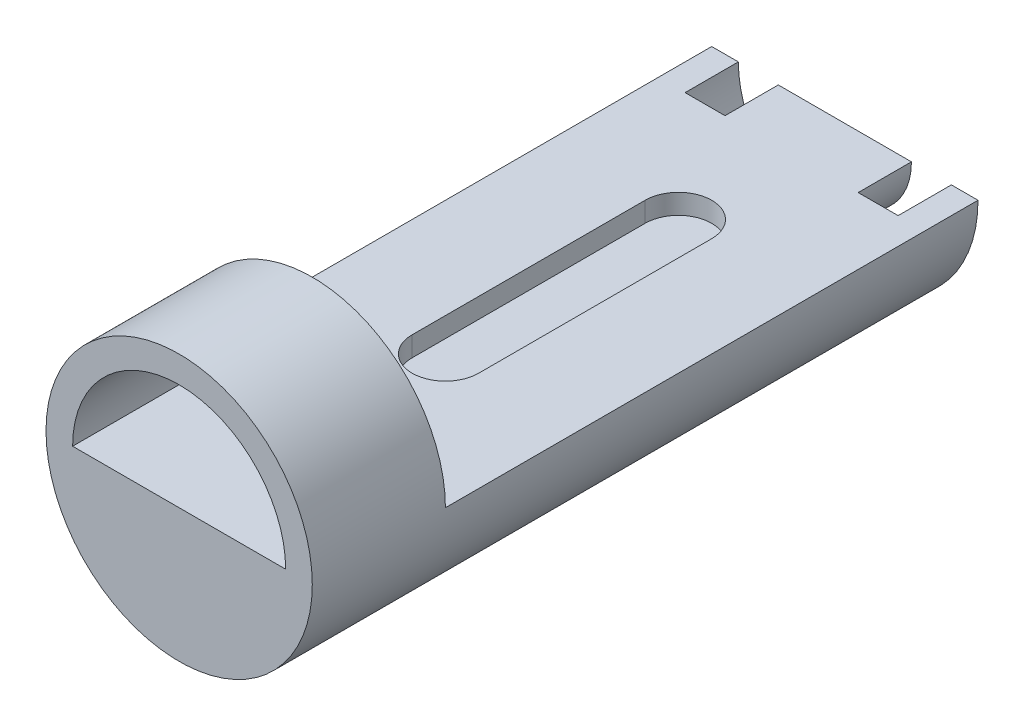
ISO-10303-21;
HEADER;
FILE_DESCRIPTION(('STEP AP214'),'2;1');
FILE_NAME('part.step','',(''),(''),'','','');
FILE_SCHEMA(('AUTOMOTIVE_DESIGN { 1 0 10303 214 1 1 1 1 }'));
ENDSEC;
DATA;
#1=APPLICATION_CONTEXT('core data for automotive mechanical design processes');
#2=APPLICATION_PROTOCOL_DEFINITION('international standard','automotive_design',2000,#1);
#3=PRODUCT_CONTEXT('',#1,'mechanical');
#4=PRODUCT('Part','Part','',(#3));
#5=PRODUCT_RELATED_PRODUCT_CATEGORY('part','',(#4));
#6=PRODUCT_DEFINITION_FORMATION('','',#4);
#7=PRODUCT_DEFINITION_CONTEXT('part definition',#1,'design');
#8=PRODUCT_DEFINITION('design','',#6,#7);
#9=PRODUCT_DEFINITION_SHAPE('','',#8);
#10=(LENGTH_UNIT() NAMED_UNIT(*) SI_UNIT(.MILLI.,.METRE.));
#11=(NAMED_UNIT(*) PLANE_ANGLE_UNIT() SI_UNIT($,.RADIAN.));
#12=(NAMED_UNIT(*) SI_UNIT($,.STERADIAN.) SOLID_ANGLE_UNIT());
#13=UNCERTAINTY_MEASURE_WITH_UNIT(LENGTH_MEASURE(1.E-05),#10,'distance_accuracy_value','');
#14=(GEOMETRIC_REPRESENTATION_CONTEXT(3) GLOBAL_UNCERTAINTY_ASSIGNED_CONTEXT((#13)) GLOBAL_UNIT_ASSIGNED_CONTEXT((#10,
#11,#12)) REPRESENTATION_CONTEXT('',''));
#15=CARTESIAN_POINT('',(0.,0.,0.));
#16=DIRECTION('',(0.,0.,1.));
#17=DIRECTION('',(1.,0.,0.));
#18=AXIS2_PLACEMENT_3D('',#15,#16,#17);
#19=CARTESIAN_POINT('',(10.,0.,100.));
#20=DIRECTION('',(0.,-1.,0.));
#21=DIRECTION('',(0.,0.,-1.));
#22=AXIS2_PLACEMENT_3D('',#19,#20,#21);
#23=PLANE('',#22);
#24=DIRECTION('',(0.,0.,1.));
#25=VECTOR('',#24,1.);
#26=CARTESIAN_POINT('',(-5.,0.,25.));
#27=LINE('',#26,#25);
#28=CARTESIAN_POINT('',(-5.,0.,25.));
#29=VERTEX_POINT('',#28);
#30=CARTESIAN_POINT('',(-5.00000000000001,0.,60.));
#31=VERTEX_POINT('',#30);
#32=EDGE_CURVE('E234',#29,#31,#27,.T.);
#33=ORIENTED_EDGE('',*,*,#32,.F.);
#34=CARTESIAN_POINT('',(0.,0.,25.));
#35=DIRECTION('',(0.,1.,0.));
#36=DIRECTION('',(0.,0.,1.));
#37=AXIS2_PLACEMENT_3D('',#34,#35,#36);
#38=CIRCLE('',#37,5.);
#39=CARTESIAN_POINT('',(5.,0.,25.));
#40=VERTEX_POINT('',#39);
#41=EDGE_CURVE('E63',#40,#29,#38,.T.);
#42=ORIENTED_EDGE('',*,*,#41,.F.);
#43=DIRECTION('',(0.,0.,1.));
#44=VECTOR('',#43,1.);
#45=CARTESIAN_POINT('',(5.,0.,25.));
#46=LINE('',#45,#44);
#47=CARTESIAN_POINT('',(4.99999999999999,0.,60.));
#48=VERTEX_POINT('',#47);
#49=EDGE_CURVE('E227',#40,#48,#46,.T.);
#50=ORIENTED_EDGE('',*,*,#49,.T.);
#51=CARTESIAN_POINT('',(0.,0.,60.));
#52=DIRECTION('',(0.,1.,0.));
#53=DIRECTION('',(0.,0.,1.));
#54=AXIS2_PLACEMENT_3D('',#51,#52,#53);
#55=CIRCLE('',#54,5.);
#56=EDGE_CURVE('E231',#31,#48,#55,.T.);
#57=ORIENTED_EDGE('',*,*,#56,.F.);
#58=EDGE_LOOP('',(#33,#42,#50,#57));
#59=FACE_BOUND('',#58,.T.);
#60=DIRECTION('',(0.,0.,1.));
#61=VECTOR('',#60,1.);
#62=CARTESIAN_POINT('',(16.,0.,80.));
#63=LINE('',#62,#61);
#64=CARTESIAN_POINT('',(16.,0.,80.));
#65=VERTEX_POINT('',#64);
#66=CARTESIAN_POINT('',(16.,0.,100.));
#67=VERTEX_POINT('',#66);
#68=EDGE_CURVE('E142',#65,#67,#63,.T.);
#69=ORIENTED_EDGE('',*,*,#68,.F.);
#70=DIRECTION('',(-1.,0.,0.));
#71=VECTOR('',#70,1.);
#72=CARTESIAN_POINT('',(0.,0.,80.));
#73=LINE('',#72,#71);
#74=CARTESIAN_POINT('',(20.,0.,80.));
#75=VERTEX_POINT('',#74);
#76=EDGE_CURVE('E128',#75,#65,#73,.T.);
#77=ORIENTED_EDGE('',*,*,#76,.F.);
#78=DIRECTION('',(0.,0.,-1.));
#79=VECTOR('',#78,1.);
#80=CARTESIAN_POINT('',(20.,0.,100.));
#81=LINE('',#80,#79);
#82=CARTESIAN_POINT('',(20.,0.,0.));
#83=VERTEX_POINT('',#82);
#84=EDGE_CURVE('E48',#75,#83,#81,.T.);
#85=ORIENTED_EDGE('',*,*,#84,.T.);
#86=DIRECTION('',(-1.,0.,0.));
#87=VECTOR('',#86,1.);
#88=CARTESIAN_POINT('',(10.,0.,0.));
#89=LINE('',#88,#87);
#90=CARTESIAN_POINT('',(16.,0.,0.));
#91=VERTEX_POINT('',#90);
#92=EDGE_CURVE('E158',#83,#91,#89,.T.);
#93=ORIENTED_EDGE('',*,*,#92,.T.);
#94=DIRECTION('',(0.,0.,-1.));
#95=VECTOR('',#94,1.);
#96=CARTESIAN_POINT('',(16.,0.,8.));
#97=LINE('',#96,#95);
#98=CARTESIAN_POINT('',(16.,0.,8.));
#99=VERTEX_POINT('',#98);
#100=EDGE_CURVE('E210',#99,#91,#97,.T.);
#101=ORIENTED_EDGE('',*,*,#100,.F.);
#102=DIRECTION('',(1.,0.,0.));
#103=VECTOR('',#102,1.);
#104=CARTESIAN_POINT('',(0.,0.,8.));
#105=LINE('',#104,#103);
#106=CARTESIAN_POINT('',(10.,0.,8.));
#107=VERTEX_POINT('',#106);
#108=EDGE_CURVE('E214',#107,#99,#105,.T.);
#109=ORIENTED_EDGE('',*,*,#108,.F.);
#110=DIRECTION('',(0.,0.,-1.));
#111=VECTOR('',#110,1.);
#112=CARTESIAN_POINT('',(10.,0.,8.));
#113=LINE('',#112,#111);
#114=CARTESIAN_POINT('',(10.,0.,0.));
#115=VERTEX_POINT('',#114);
#116=EDGE_CURVE('E163',#107,#115,#113,.T.);
#117=ORIENTED_EDGE('',*,*,#116,.T.);
#118=CARTESIAN_POINT('',(-10.,0.,0.));
#119=VERTEX_POINT('',#118);
#120=EDGE_CURVE('E173',#115,#119,#89,.T.);
#121=ORIENTED_EDGE('',*,*,#120,.T.);
#122=DIRECTION('',(0.,0.,-1.));
#123=VECTOR('',#122,1.);
#124=CARTESIAN_POINT('',(-10.,0.,8.));
#125=LINE('',#124,#123);
#126=CARTESIAN_POINT('',(-10.,0.,8.));
#127=VERTEX_POINT('',#126);
#128=EDGE_CURVE('E171',#127,#119,#125,.T.);
#129=ORIENTED_EDGE('',*,*,#128,.F.);
#130=CARTESIAN_POINT('',(-16.,0.,8.));
#131=VERTEX_POINT('',#130);
#132=EDGE_CURVE('E212',#131,#127,#105,.T.);
#133=ORIENTED_EDGE('',*,*,#132,.F.);
#134=DIRECTION('',(0.,0.,-1.));
#135=VECTOR('',#134,1.);
#136=CARTESIAN_POINT('',(-16.,0.,8.));
#137=LINE('',#136,#135);
#138=CARTESIAN_POINT('',(-16.,0.,0.));
#139=VERTEX_POINT('',#138);
#140=EDGE_CURVE('E188',#131,#139,#137,.T.);
#141=ORIENTED_EDGE('',*,*,#140,.T.);
#142=CARTESIAN_POINT('',(-20.,0.,0.));
#143=VERTEX_POINT('',#142);
#144=EDGE_CURVE('E170',#139,#143,#89,.T.);
#145=ORIENTED_EDGE('',*,*,#144,.T.);
#146=DIRECTION('',(0.,0.,-1.));
#147=VECTOR('',#146,1.);
#148=CARTESIAN_POINT('',(-20.,0.,100.));
#149=LINE('',#148,#147);
#150=CARTESIAN_POINT('',(-20.,0.,80.));
#151=VERTEX_POINT('',#150);
#152=EDGE_CURVE('E11',#151,#143,#149,.T.);
#153=ORIENTED_EDGE('',*,*,#152,.F.);
#154=CARTESIAN_POINT('',(-16.,0.,80.));
#155=VERTEX_POINT('',#154);
#156=EDGE_CURVE('E139',#155,#151,#73,.T.);
#157=ORIENTED_EDGE('',*,*,#156,.F.);
#158=DIRECTION('',(0.,0.,1.));
#159=VECTOR('',#158,1.);
#160=CARTESIAN_POINT('',(-16.,0.,80.));
#161=LINE('',#160,#159);
#162=CARTESIAN_POINT('',(-16.,0.,100.));
#163=VERTEX_POINT('',#162);
#164=EDGE_CURVE('E145',#155,#163,#161,.T.);
#165=ORIENTED_EDGE('',*,*,#164,.T.);
#166=DIRECTION('',(-1.,0.,0.));
#167=VECTOR('',#166,1.);
#168=CARTESIAN_POINT('',(0.,0.,100.));
#169=LINE('',#168,#167);
#170=EDGE_CURVE('E148',#67,#163,#169,.T.);
#171=ORIENTED_EDGE('',*,*,#170,.F.);
#172=EDGE_LOOP('',(#69,#77,#85,#93,#101,#109,#117,#121,#129,#133,#141,#145,#153,#157,#165,#171));
#173=FACE_BOUND('',#172,.T.);
#174=ADVANCED_FACE('F39',(#59,#173),#23,.F.);
#175=CARTESIAN_POINT('',(0.,0.,0.));
#176=DIRECTION('',(0.,0.,1.));
#177=DIRECTION('',(1.,0.,0.));
#178=AXIS2_PLACEMENT_3D('',#175,#176,#177);
#179=PLANE('',#178);
#180=CARTESIAN_POINT('',(0.,0.,0.));
#181=DIRECTION('',(0.,0.,-1.));
#182=DIRECTION('',(-1.,0.,0.));
#183=AXIS2_PLACEMENT_3D('',#180,#181,#182);
#184=CIRCLE('',#183,10.);
#185=EDGE_CURVE('E197',#115,#119,#184,.T.);
#186=ORIENTED_EDGE('',*,*,#185,.T.);
#187=ORIENTED_EDGE('',*,*,#120,.F.);
#188=EDGE_LOOP('',(#186,#187));
#189=FACE_BOUND('',#188,.T.);
#190=ADVANCED_FACE('F196',(#189),#179,.F.);
#191=CARTESIAN_POINT('',(0.,0.,100.));
#192=DIRECTION('',(0.,0.,-1.));
#193=DIRECTION('',(-1.,0.,0.));
#194=AXIS2_PLACEMENT_3D('',#191,#192,#193);
#195=CYLINDRICAL_SURFACE('',#194,20.);
#196=CARTESIAN_POINT('',(0.,0.,80.));
#197=DIRECTION('',(0.,0.,1.));
#198=DIRECTION('',(1.,0.,0.));
#199=AXIS2_PLACEMENT_3D('',#196,#197,#198);
#200=CIRCLE('',#199,20.);
#201=EDGE_CURVE('E134',#75,#151,#200,.T.);
#202=ORIENTED_EDGE('',*,*,#201,.T.);
#203=ORIENTED_EDGE('',*,*,#152,.T.);
#204=CARTESIAN_POINT('',(0.,0.,0.));
#205=DIRECTION('',(0.,0.,1.));
#206=DIRECTION('',(1.,0.,0.));
#207=AXIS2_PLACEMENT_3D('',#204,#205,#206);
#208=CIRCLE('',#207,20.);
#209=EDGE_CURVE('E167',#143,#83,#208,.T.);
#210=ORIENTED_EDGE('',*,*,#209,.T.);
#211=ORIENTED_EDGE('',*,*,#84,.F.);
#212=EDGE_LOOP('',(#202,#203,#210,#211));
#213=FACE_BOUND('',#212,.T.);
#214=CARTESIAN_POINT('',(0.,0.,100.));
#215=DIRECTION('',(0.,0.,1.));
#216=DIRECTION('',(1.,0.,0.));
#217=AXIS2_PLACEMENT_3D('',#214,#215,#216);
#218=CIRCLE('',#217,20.);
#219=CARTESIAN_POINT('',(20.,0.,100.));
#220=VERTEX_POINT('',#219);
#221=EDGE_CURVE('E157',#220,#220,#218,.T.);
#222=ORIENTED_EDGE('',*,*,#221,.F.);
#223=EDGE_LOOP('',(#222));
#224=FACE_BOUND('',#223,.T.);
#225=ADVANCED_FACE('F41',(#213,#224),#195,.T.);
#226=CARTESIAN_POINT('',(0.,0.,100.));
#227=DIRECTION('',(0.,0.,1.));
#228=DIRECTION('',(1.,0.,0.));
#229=AXIS2_PLACEMENT_3D('',#226,#227,#228);
#230=PLANE('',#229);
#231=ORIENTED_EDGE('',*,*,#221,.T.);
#232=EDGE_LOOP('',(#231));
#233=FACE_BOUND('',#232,.T.);
#234=ORIENTED_EDGE('',*,*,#170,.T.);
#235=CARTESIAN_POINT('',(0.,0.,100.));
#236=DIRECTION('',(0.,0.,1.));
#237=DIRECTION('',(1.,0.,0.));
#238=AXIS2_PLACEMENT_3D('',#235,#236,#237);
#239=CIRCLE('',#238,16.);
#240=EDGE_CURVE('E55',#67,#163,#239,.T.);
#241=ORIENTED_EDGE('',*,*,#240,.F.);
#242=EDGE_LOOP('',(#234,#241));
#243=FACE_BOUND('',#242,.T.);
#244=ADVANCED_FACE('F273',(#233,#243),#230,.T.);
#245=ORIENTED_EDGE('',*,*,#144,.F.);
#246=CARTESIAN_POINT('',(0.,0.,0.));
#247=DIRECTION('',(0.,0.,-1.));
#248=DIRECTION('',(-1.,0.,0.));
#249=AXIS2_PLACEMENT_3D('',#246,#247,#248);
#250=CIRCLE('',#249,16.);
#251=EDGE_CURVE('E182',#91,#139,#250,.T.);
#252=ORIENTED_EDGE('',*,*,#251,.F.);
#253=ORIENTED_EDGE('',*,*,#92,.F.);
#254=ORIENTED_EDGE('',*,*,#209,.F.);
#255=EDGE_LOOP('',(#245,#252,#253,#254));
#256=FACE_BOUND('',#255,.T.);
#257=ADVANCED_FACE('F181',(#256),#179,.F.);
#258=CARTESIAN_POINT('',(0.,0.,8.));
#259=DIRECTION('',(0.,0.,-1.));
#260=DIRECTION('',(-1.,0.,0.));
#261=AXIS2_PLACEMENT_3D('',#258,#259,#260);
#262=CYLINDRICAL_SURFACE('',#261,10.);
#263=ORIENTED_EDGE('',*,*,#185,.F.);
#264=ORIENTED_EDGE('',*,*,#116,.F.);
#265=CARTESIAN_POINT('',(0.,0.,8.));
#266=DIRECTION('',(0.,0.,-1.));
#267=DIRECTION('',(-1.,0.,0.));
#268=AXIS2_PLACEMENT_3D('',#265,#266,#267);
#269=CIRCLE('',#268,10.);
#270=EDGE_CURVE('E201',#107,#127,#269,.T.);
#271=ORIENTED_EDGE('',*,*,#270,.T.);
#272=ORIENTED_EDGE('',*,*,#128,.T.);
#273=EDGE_LOOP('',(#263,#264,#271,#272));
#274=FACE_BOUND('',#273,.T.);
#275=ADVANCED_FACE('F272',(#274),#262,.T.);
#276=CARTESIAN_POINT('',(0.,0.,8.));
#277=DIRECTION('',(0.,0.,-1.));
#278=DIRECTION('',(-1.,0.,0.));
#279=AXIS2_PLACEMENT_3D('',#276,#277,#278);
#280=CYLINDRICAL_SURFACE('',#279,16.);
#281=ORIENTED_EDGE('',*,*,#251,.T.);
#282=ORIENTED_EDGE('',*,*,#140,.F.);
#283=CARTESIAN_POINT('',(0.,0.,8.));
#284=DIRECTION('',(0.,0.,-1.));
#285=DIRECTION('',(-1.,0.,0.));
#286=AXIS2_PLACEMENT_3D('',#283,#284,#285);
#287=CIRCLE('',#286,16.);
#288=EDGE_CURVE('E206',#99,#131,#287,.T.);
#289=ORIENTED_EDGE('',*,*,#288,.F.);
#290=ORIENTED_EDGE('',*,*,#100,.T.);
#291=EDGE_LOOP('',(#281,#282,#289,#290));
#292=FACE_BOUND('',#291,.T.);
#293=ADVANCED_FACE('F279',(#292),#280,.F.);
#294=CARTESIAN_POINT('',(0.,0.,8.));
#295=DIRECTION('',(0.,0.,-1.));
#296=DIRECTION('',(-1.,0.,0.));
#297=AXIS2_PLACEMENT_3D('',#294,#295,#296);
#298=PLANE('',#297);
#299=ORIENTED_EDGE('',*,*,#270,.F.);
#300=ORIENTED_EDGE('',*,*,#108,.T.);
#301=ORIENTED_EDGE('',*,*,#288,.T.);
#302=ORIENTED_EDGE('',*,*,#132,.T.);
#303=EDGE_LOOP('',(#299,#300,#301,#302));
#304=FACE_BOUND('',#303,.T.);
#305=ADVANCED_FACE('F282',(#304),#298,.T.);
#306=CARTESIAN_POINT('',(0.,-3.,25.));
#307=DIRECTION('',(0.,1.,0.));
#308=DIRECTION('',(0.,0.,1.));
#309=AXIS2_PLACEMENT_3D('',#306,#307,#308);
#310=CYLINDRICAL_SURFACE('',#309,5.);
#311=ORIENTED_EDGE('',*,*,#41,.T.);
#312=DIRECTION('',(0.,1.,0.));
#313=VECTOR('',#312,1.);
#314=CARTESIAN_POINT('',(-5.,-3.,25.));
#315=LINE('',#314,#313);
#316=CARTESIAN_POINT('',(-5.,-3.,25.));
#317=VERTEX_POINT('',#316);
#318=EDGE_CURVE('E221',#317,#29,#315,.T.);
#319=ORIENTED_EDGE('',*,*,#318,.F.);
#320=CARTESIAN_POINT('',(0.,-3.,25.));
#321=DIRECTION('',(0.,1.,0.));
#322=DIRECTION('',(0.,0.,1.));
#323=AXIS2_PLACEMENT_3D('',#320,#321,#322);
#324=CIRCLE('',#323,5.);
#325=CARTESIAN_POINT('',(5.,-3.,25.));
#326=VERTEX_POINT('',#325);
#327=EDGE_CURVE('E230',#326,#317,#324,.T.);
#328=ORIENTED_EDGE('',*,*,#327,.F.);
#329=DIRECTION('',(0.,1.,0.));
#330=VECTOR('',#329,1.);
#331=CARTESIAN_POINT('',(5.,-3.,25.));
#332=LINE('',#331,#330);
#333=EDGE_CURVE('E199',#326,#40,#332,.T.);
#334=ORIENTED_EDGE('',*,*,#333,.T.);
#335=EDGE_LOOP('',(#311,#319,#328,#334));
#336=FACE_BOUND('',#335,.T.);
#337=ADVANCED_FACE('F252',(#336),#310,.F.);
#338=CARTESIAN_POINT('',(5.,-3.,25.));
#339=DIRECTION('',(-1.,0.,0.));
#340=DIRECTION('',(0.,0.,1.));
#341=AXIS2_PLACEMENT_3D('',#338,#339,#340);
#342=PLANE('',#341);
#343=ORIENTED_EDGE('',*,*,#49,.F.);
#344=ORIENTED_EDGE('',*,*,#333,.F.);
#345=DIRECTION('',(0.,0.,1.));
#346=VECTOR('',#345,1.);
#347=CARTESIAN_POINT('',(5.,-3.,25.));
#348=LINE('',#347,#346);
#349=CARTESIAN_POINT('',(4.99999999999999,-3.,60.));
#350=VERTEX_POINT('',#349);
#351=EDGE_CURVE('E224',#326,#350,#348,.T.);
#352=ORIENTED_EDGE('',*,*,#351,.T.);
#353=DIRECTION('',(0.,1.,0.));
#354=VECTOR('',#353,1.);
#355=CARTESIAN_POINT('',(4.99999999999999,-3.,60.));
#356=LINE('',#355,#354);
#357=EDGE_CURVE('E203',#350,#48,#356,.T.);
#358=ORIENTED_EDGE('',*,*,#357,.T.);
#359=EDGE_LOOP('',(#343,#344,#352,#358));
#360=FACE_BOUND('',#359,.T.);
#361=ADVANCED_FACE('F263',(#360),#342,.T.);
#362=CARTESIAN_POINT('',(0.,-3.,60.));
#363=DIRECTION('',(0.,1.,0.));
#364=DIRECTION('',(0.,0.,1.));
#365=AXIS2_PLACEMENT_3D('',#362,#363,#364);
#366=CYLINDRICAL_SURFACE('',#365,5.);
#367=ORIENTED_EDGE('',*,*,#56,.T.);
#368=ORIENTED_EDGE('',*,*,#357,.F.);
#369=CARTESIAN_POINT('',(0.,-3.,60.));
#370=DIRECTION('',(0.,1.,0.));
#371=DIRECTION('',(0.,0.,1.));
#372=AXIS2_PLACEMENT_3D('',#369,#370,#371);
#373=CIRCLE('',#372,5.);
#374=CARTESIAN_POINT('',(-5.00000000000001,-3.,60.));
#375=VERTEX_POINT('',#374);
#376=EDGE_CURVE('E239',#375,#350,#373,.T.);
#377=ORIENTED_EDGE('',*,*,#376,.F.);
#378=DIRECTION('',(0.,1.,0.));
#379=VECTOR('',#378,1.);
#380=CARTESIAN_POINT('',(-5.00000000000001,-3.,60.));
#381=LINE('',#380,#379);
#382=EDGE_CURVE('E223',#375,#31,#381,.T.);
#383=ORIENTED_EDGE('',*,*,#382,.T.);
#384=EDGE_LOOP('',(#367,#368,#377,#383));
#385=FACE_BOUND('',#384,.T.);
#386=ADVANCED_FACE('F261',(#385),#366,.F.);
#387=CARTESIAN_POINT('',(-5.,-3.,25.));
#388=DIRECTION('',(-1.,0.,0.));
#389=DIRECTION('',(0.,0.,1.));
#390=AXIS2_PLACEMENT_3D('',#387,#388,#389);
#391=PLANE('',#390);
#392=ORIENTED_EDGE('',*,*,#32,.T.);
#393=ORIENTED_EDGE('',*,*,#382,.F.);
#394=DIRECTION('',(0.,0.,1.));
#395=VECTOR('',#394,1.);
#396=CARTESIAN_POINT('',(-5.,-3.,25.));
#397=LINE('',#396,#395);
#398=EDGE_CURVE('E242',#317,#375,#397,.T.);
#399=ORIENTED_EDGE('',*,*,#398,.F.);
#400=ORIENTED_EDGE('',*,*,#318,.T.);
#401=EDGE_LOOP('',(#392,#393,#399,#400));
#402=FACE_BOUND('',#401,.T.);
#403=ADVANCED_FACE('F256',(#402),#391,.F.);
#404=CARTESIAN_POINT('',(0.,-3.,25.));
#405=DIRECTION('',(0.,1.,0.));
#406=DIRECTION('',(0.,0.,1.));
#407=AXIS2_PLACEMENT_3D('',#404,#405,#406);
#408=PLANE('',#407);
#409=ORIENTED_EDGE('',*,*,#327,.T.);
#410=ORIENTED_EDGE('',*,*,#398,.T.);
#411=ORIENTED_EDGE('',*,*,#376,.T.);
#412=ORIENTED_EDGE('',*,*,#351,.F.);
#413=EDGE_LOOP('',(#409,#410,#411,#412));
#414=FACE_BOUND('',#413,.T.);
#415=ADVANCED_FACE('F250',(#414),#408,.T.);
#416=CARTESIAN_POINT('',(0.,0.,80.));
#417=DIRECTION('',(0.,0.,1.));
#418=DIRECTION('',(1.,0.,0.));
#419=AXIS2_PLACEMENT_3D('',#416,#417,#418);
#420=CYLINDRICAL_SURFACE('',#419,16.);
#421=ORIENTED_EDGE('',*,*,#240,.T.);
#422=ORIENTED_EDGE('',*,*,#164,.F.);
#423=CARTESIAN_POINT('',(0.,0.,80.));
#424=DIRECTION('',(0.,0.,1.));
#425=DIRECTION('',(1.,0.,0.));
#426=AXIS2_PLACEMENT_3D('',#423,#424,#425);
#427=CIRCLE('',#426,16.);
#428=EDGE_CURVE('E131',#65,#155,#427,.T.);
#429=ORIENTED_EDGE('',*,*,#428,.F.);
#430=ORIENTED_EDGE('',*,*,#68,.T.);
#431=EDGE_LOOP('',(#421,#422,#429,#430));
#432=FACE_BOUND('',#431,.T.);
#433=ADVANCED_FACE('F141',(#432),#420,.F.);
#434=CARTESIAN_POINT('',(0.,0.,80.));
#435=DIRECTION('',(0.,0.,1.));
#436=DIRECTION('',(1.,0.,0.));
#437=AXIS2_PLACEMENT_3D('',#434,#435,#436);
#438=PLANE('',#437);
#439=ORIENTED_EDGE('',*,*,#428,.T.);
#440=ORIENTED_EDGE('',*,*,#156,.T.);
#441=ORIENTED_EDGE('',*,*,#201,.F.);
#442=ORIENTED_EDGE('',*,*,#76,.T.);
#443=EDGE_LOOP('',(#439,#440,#441,#442));
#444=FACE_BOUND('',#443,.T.);
#445=ADVANCED_FACE('F130',(#444),#438,.F.);
#446=CLOSED_SHELL('',(#174,#190,#225,#244,#257,#275,#293,#305,#337,#361,#386,#403,#415,#433,#445));
#447=MANIFOLD_SOLID_BREP('B2',#446);
#448=ADVANCED_BREP_SHAPE_REPRESENTATION('',(#18,#447),#14);
#449=SHAPE_DEFINITION_REPRESENTATION(#9,#448);
ENDSEC;
END-ISO-10303-21;
